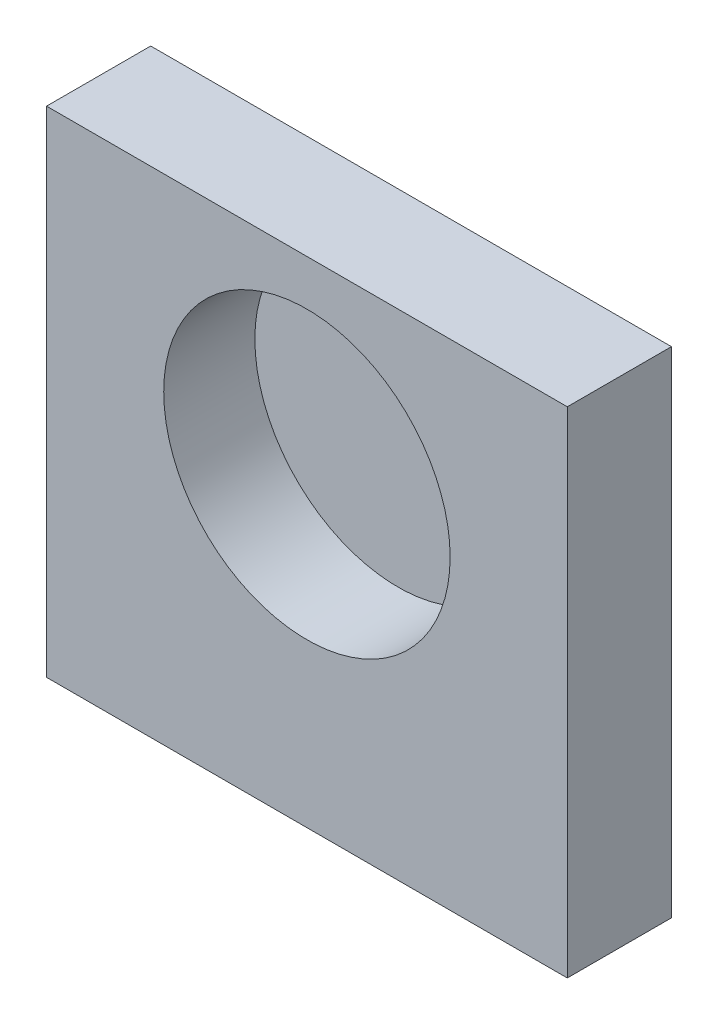
ISO-10303-21;
HEADER;
FILE_DESCRIPTION(('STEP AP214'),'2;1');
FILE_NAME('part.step','',(''),(''),'','','');
FILE_SCHEMA(('AUTOMOTIVE_DESIGN { 1 0 10303 214 1 1 1 1 }'));
ENDSEC;
DATA;
#1=APPLICATION_CONTEXT('core data for automotive mechanical design processes');
#2=APPLICATION_PROTOCOL_DEFINITION('international standard','automotive_design',2000,#1);
#3=PRODUCT_CONTEXT('',#1,'mechanical');
#4=PRODUCT('Part','Part','',(#3));
#5=PRODUCT_RELATED_PRODUCT_CATEGORY('part','',(#4));
#6=PRODUCT_DEFINITION_FORMATION('','',#4);
#7=PRODUCT_DEFINITION_CONTEXT('part definition',#1,'design');
#8=PRODUCT_DEFINITION('design','',#6,#7);
#9=PRODUCT_DEFINITION_SHAPE('','',#8);
#10=(LENGTH_UNIT() NAMED_UNIT(*) SI_UNIT(.MILLI.,.METRE.));
#11=(NAMED_UNIT(*) PLANE_ANGLE_UNIT() SI_UNIT($,.RADIAN.));
#12=(NAMED_UNIT(*) SI_UNIT($,.STERADIAN.) SOLID_ANGLE_UNIT());
#13=UNCERTAINTY_MEASURE_WITH_UNIT(LENGTH_MEASURE(1.E-05),#10,'distance_accuracy_value','');
#14=(GEOMETRIC_REPRESENTATION_CONTEXT(3) GLOBAL_UNCERTAINTY_ASSIGNED_CONTEXT((#13)) GLOBAL_UNIT_ASSIGNED_CONTEXT((#10,
#11,#12)) REPRESENTATION_CONTEXT('',''));
#15=CARTESIAN_POINT('',(0.,0.,0.));
#16=DIRECTION('',(0.,0.,1.));
#17=DIRECTION('',(1.,0.,0.));
#18=AXIS2_PLACEMENT_3D('',#15,#16,#17);
#19=CARTESIAN_POINT('',(-20.,-19.,8.));
#20=DIRECTION('',(1.,0.,0.));
#21=DIRECTION('',(0.,0.,-1.));
#22=AXIS2_PLACEMENT_3D('',#19,#20,#21);
#23=PLANE('',#22);
#24=DIRECTION('',(0.,-1.,0.));
#25=VECTOR('',#24,1.);
#26=CARTESIAN_POINT('',(-20.,-19.,0.));
#27=LINE('',#26,#25);
#28=CARTESIAN_POINT('',(-20.,19.,0.));
#29=VERTEX_POINT('',#28);
#30=CARTESIAN_POINT('',(-20.,-19.,0.));
#31=VERTEX_POINT('',#30);
#32=EDGE_CURVE('E126',#29,#31,#27,.T.);
#33=ORIENTED_EDGE('',*,*,#32,.T.);
#34=DIRECTION('',(0.,0.,-1.));
#35=VECTOR('',#34,1.);
#36=CARTESIAN_POINT('',(-20.,-19.,8.));
#37=LINE('',#36,#35);
#38=CARTESIAN_POINT('',(-20.,-19.,8.));
#39=VERTEX_POINT('',#38);
#40=EDGE_CURVE('E11',#39,#31,#37,.T.);
#41=ORIENTED_EDGE('',*,*,#40,.F.);
#42=DIRECTION('',(0.,-1.,0.));
#43=VECTOR('',#42,1.);
#44=CARTESIAN_POINT('',(-20.,-19.,8.));
#45=LINE('',#44,#43);
#46=CARTESIAN_POINT('',(-20.,19.,8.));
#47=VERTEX_POINT('',#46);
#48=EDGE_CURVE('E129',#47,#39,#45,.T.);
#49=ORIENTED_EDGE('',*,*,#48,.F.);
#50=DIRECTION('',(0.,0.,-1.));
#51=VECTOR('',#50,1.);
#52=CARTESIAN_POINT('',(-20.,19.,8.));
#53=LINE('',#52,#51);
#54=EDGE_CURVE('E135',#47,#29,#53,.T.);
#55=ORIENTED_EDGE('',*,*,#54,.T.);
#56=EDGE_LOOP('',(#33,#41,#49,#55));
#57=FACE_BOUND('',#56,.T.);
#58=ADVANCED_FACE('F42',(#57),#23,.F.);
#59=CARTESIAN_POINT('',(20.,-19.,8.));
#60=DIRECTION('',(0.,1.,0.));
#61=DIRECTION('',(-1.,0.,0.));
#62=AXIS2_PLACEMENT_3D('',#59,#60,#61);
#63=PLANE('',#62);
#64=CARTESIAN_POINT('',(12.,-19.,4.));
#65=DIRECTION('',(0.,-1.,0.));
#66=DIRECTION('',(0.,0.,-1.));
#67=AXIS2_PLACEMENT_3D('',#64,#65,#66);
#68=CIRCLE('',#67,1.883);
#69=CARTESIAN_POINT('',(12.,-19.,2.117));
#70=VERTEX_POINT('',#69);
#71=EDGE_CURVE('E113',#70,#70,#68,.T.);
#72=ORIENTED_EDGE('',*,*,#71,.F.);
#73=EDGE_LOOP('',(#72));
#74=FACE_BOUND('',#73,.T.);
#75=CARTESIAN_POINT('',(-12.,-19.,4.));
#76=DIRECTION('',(0.,-1.,0.));
#77=DIRECTION('',(0.,0.,-1.));
#78=AXIS2_PLACEMENT_3D('',#75,#76,#77);
#79=CIRCLE('',#78,1.883);
#80=CARTESIAN_POINT('',(-12.,-19.,2.117));
#81=VERTEX_POINT('',#80);
#82=EDGE_CURVE('E106',#81,#81,#79,.T.);
#83=ORIENTED_EDGE('',*,*,#82,.F.);
#84=EDGE_LOOP('',(#83));
#85=FACE_BOUND('',#84,.T.);
#86=DIRECTION('',(1.,0.,0.));
#87=VECTOR('',#86,1.);
#88=CARTESIAN_POINT('',(20.,-19.,0.));
#89=LINE('',#88,#87);
#90=CARTESIAN_POINT('',(20.,-19.,0.));
#91=VERTEX_POINT('',#90);
#92=EDGE_CURVE('E138',#31,#91,#89,.T.);
#93=ORIENTED_EDGE('',*,*,#92,.T.);
#94=DIRECTION('',(0.,0.,-1.));
#95=VECTOR('',#94,1.);
#96=CARTESIAN_POINT('',(20.,-19.,8.));
#97=LINE('',#96,#95);
#98=CARTESIAN_POINT('',(20.,-19.,8.));
#99=VERTEX_POINT('',#98);
#100=EDGE_CURVE('E50',#99,#91,#97,.T.);
#101=ORIENTED_EDGE('',*,*,#100,.F.);
#102=DIRECTION('',(1.,0.,0.));
#103=VECTOR('',#102,1.);
#104=CARTESIAN_POINT('',(20.,-19.,8.));
#105=LINE('',#104,#103);
#106=EDGE_CURVE('E89',#39,#99,#105,.T.);
#107=ORIENTED_EDGE('',*,*,#106,.F.);
#108=ORIENTED_EDGE('',*,*,#40,.T.);
#109=EDGE_LOOP('',(#93,#101,#107,#108));
#110=FACE_BOUND('',#109,.T.);
#111=ADVANCED_FACE('F162',(#74,#85,#110),#63,.F.);
#112=CARTESIAN_POINT('',(20.,-19.,8.));
#113=DIRECTION('',(-1.,0.,0.));
#114=DIRECTION('',(0.,0.,1.));
#115=AXIS2_PLACEMENT_3D('',#112,#113,#114);
#116=PLANE('',#115);
#117=DIRECTION('',(0.,1.,0.));
#118=VECTOR('',#117,1.);
#119=CARTESIAN_POINT('',(20.,-19.,0.));
#120=LINE('',#119,#118);
#121=CARTESIAN_POINT('',(20.,19.,0.));
#122=VERTEX_POINT('',#121);
#123=EDGE_CURVE('E76',#91,#122,#120,.T.);
#124=ORIENTED_EDGE('',*,*,#123,.T.);
#125=DIRECTION('',(0.,0.,-1.));
#126=VECTOR('',#125,1.);
#127=CARTESIAN_POINT('',(20.,19.,8.));
#128=LINE('',#127,#126);
#129=CARTESIAN_POINT('',(20.,19.,8.));
#130=VERTEX_POINT('',#129);
#131=EDGE_CURVE('E143',#130,#122,#128,.T.);
#132=ORIENTED_EDGE('',*,*,#131,.F.);
#133=DIRECTION('',(0.,1.,0.));
#134=VECTOR('',#133,1.);
#135=CARTESIAN_POINT('',(20.,-19.,8.));
#136=LINE('',#135,#134);
#137=EDGE_CURVE('E132',#99,#130,#136,.T.);
#138=ORIENTED_EDGE('',*,*,#137,.F.);
#139=ORIENTED_EDGE('',*,*,#100,.T.);
#140=EDGE_LOOP('',(#124,#132,#138,#139));
#141=FACE_BOUND('',#140,.T.);
#142=ADVANCED_FACE('F145',(#141),#116,.F.);
#143=CARTESIAN_POINT('',(20.,19.,8.));
#144=DIRECTION('',(0.,-1.,0.));
#145=DIRECTION('',(1.,0.,0.));
#146=AXIS2_PLACEMENT_3D('',#143,#144,#145);
#147=PLANE('',#146);
#148=DIRECTION('',(-1.,0.,0.));
#149=VECTOR('',#148,1.);
#150=CARTESIAN_POINT('',(20.,19.,0.));
#151=LINE('',#150,#149);
#152=EDGE_CURVE('E82',#122,#29,#151,.T.);
#153=ORIENTED_EDGE('',*,*,#152,.T.);
#154=ORIENTED_EDGE('',*,*,#54,.F.);
#155=DIRECTION('',(-1.,0.,0.));
#156=VECTOR('',#155,1.);
#157=CARTESIAN_POINT('',(20.,19.,8.));
#158=LINE('',#157,#156);
#159=EDGE_CURVE('E58',#130,#47,#158,.T.);
#160=ORIENTED_EDGE('',*,*,#159,.F.);
#161=ORIENTED_EDGE('',*,*,#131,.T.);
#162=EDGE_LOOP('',(#153,#154,#160,#161));
#163=FACE_BOUND('',#162,.T.);
#164=ADVANCED_FACE('F152',(#163),#147,.F.);
#165=CARTESIAN_POINT('',(0.,0.,8.));
#166=DIRECTION('',(0.,0.,1.));
#167=DIRECTION('',(1.,0.,0.));
#168=AXIS2_PLACEMENT_3D('',#165,#166,#167);
#169=PLANE('',#168);
#170=CARTESIAN_POINT('',(0.,4.5,8.));
#171=DIRECTION('',(0.,0.,1.));
#172=DIRECTION('',(1.,0.,0.));
#173=AXIS2_PLACEMENT_3D('',#170,#171,#172);
#174=CIRCLE('',#173,11.);
#175=CARTESIAN_POINT('',(11.,4.5,8.));
#176=VERTEX_POINT('',#175);
#177=EDGE_CURVE('E122',#176,#176,#174,.T.);
#178=ORIENTED_EDGE('',*,*,#177,.F.);
#179=EDGE_LOOP('',(#178));
#180=FACE_BOUND('',#179,.T.);
#181=ORIENTED_EDGE('',*,*,#48,.T.);
#182=ORIENTED_EDGE('',*,*,#106,.T.);
#183=ORIENTED_EDGE('',*,*,#137,.T.);
#184=ORIENTED_EDGE('',*,*,#159,.T.);
#185=EDGE_LOOP('',(#181,#182,#183,#184));
#186=FACE_BOUND('',#185,.T.);
#187=ADVANCED_FACE('F154',(#180,#186),#169,.T.);
#188=CARTESIAN_POINT('',(0.,0.,0.));
#189=DIRECTION('',(0.,0.,1.));
#190=DIRECTION('',(1.,0.,0.));
#191=AXIS2_PLACEMENT_3D('',#188,#189,#190);
#192=PLANE('',#191);
#193=ORIENTED_EDGE('',*,*,#32,.F.);
#194=ORIENTED_EDGE('',*,*,#152,.F.);
#195=ORIENTED_EDGE('',*,*,#123,.F.);
#196=ORIENTED_EDGE('',*,*,#92,.F.);
#197=EDGE_LOOP('',(#193,#194,#195,#196));
#198=FACE_BOUND('',#197,.T.);
#199=ADVANCED_FACE('F148',(#198),#192,.F.);
#200=CARTESIAN_POINT('',(0.,4.5,1.));
#201=DIRECTION('',(0.,0.,1.));
#202=DIRECTION('',(1.,0.,0.));
#203=AXIS2_PLACEMENT_3D('',#200,#201,#202);
#204=CYLINDRICAL_SURFACE('',#203,11.);
#205=CARTESIAN_POINT('',(0.,4.5,1.));
#206=DIRECTION('',(0.,0.,1.));
#207=DIRECTION('',(1.,0.,0.));
#208=AXIS2_PLACEMENT_3D('',#205,#206,#207);
#209=CIRCLE('',#208,11.);
#210=CARTESIAN_POINT('',(11.,4.5,1.));
#211=VERTEX_POINT('',#210);
#212=EDGE_CURVE('E123',#211,#211,#209,.T.);
#213=ORIENTED_EDGE('',*,*,#212,.F.);
#214=EDGE_LOOP('',(#213));
#215=FACE_BOUND('',#214,.T.);
#216=ORIENTED_EDGE('',*,*,#177,.T.);
#217=EDGE_LOOP('',(#216));
#218=FACE_BOUND('',#217,.T.);
#219=ADVANCED_FACE('F196',(#215,#218),#204,.F.);
#220=CARTESIAN_POINT('',(0.,4.5,1.));
#221=DIRECTION('',(0.,0.,1.));
#222=DIRECTION('',(1.,0.,0.));
#223=AXIS2_PLACEMENT_3D('',#220,#221,#222);
#224=PLANE('',#223);
#225=ORIENTED_EDGE('',*,*,#212,.T.);
#226=EDGE_LOOP('',(#225));
#227=FACE_BOUND('',#226,.T.);
#228=ADVANCED_FACE('F192',(#227),#224,.T.);
#229=CARTESIAN_POINT('',(-12.,-9.,4.));
#230=DIRECTION('',(0.,-1.,0.));
#231=DIRECTION('',(0.,0.,-1.));
#232=AXIS2_PLACEMENT_3D('',#229,#230,#231);
#233=CONICAL_SURFACE('',#232,1.575,1.02974425867665);
#234=CARTESIAN_POINT('',(-12.,-8.05364452503159,4.));
#235=VERTEX_POINT('',#234);
#236=VERTEX_LOOP('',#235);
#237=FACE_BOUND('',#236,.T.);
#238=CARTESIAN_POINT('',(-12.,-9.,4.));
#239=DIRECTION('',(0.,-1.,0.));
#240=DIRECTION('',(0.,0.,-1.));
#241=AXIS2_PLACEMENT_3D('',#238,#239,#240);
#242=CIRCLE('',#241,1.575);
#243=CARTESIAN_POINT('',(-12.,-9.,2.425));
#244=VERTEX_POINT('',#243);
#245=EDGE_CURVE('E119',#244,#244,#242,.T.);
#246=ORIENTED_EDGE('',*,*,#245,.T.);
#247=EDGE_LOOP('',(#246));
#248=FACE_BOUND('',#247,.T.);
#249=ADVANCED_FACE('F184',(#237,#248),#233,.F.);
#250=CARTESIAN_POINT('',(-12.,-19.,4.));
#251=DIRECTION('',(0.,-1.,0.));
#252=DIRECTION('',(0.,0.,-1.));
#253=AXIS2_PLACEMENT_3D('',#250,#251,#252);
#254=CYLINDRICAL_SURFACE('',#253,1.575);
#255=ORIENTED_EDGE('',*,*,#245,.F.);
#256=EDGE_LOOP('',(#255));
#257=FACE_BOUND('',#256,.T.);
#258=CARTESIAN_POINT('',(-12.,-18.692,4.));
#259=DIRECTION('',(0.,-1.,0.));
#260=DIRECTION('',(0.,0.,-1.));
#261=AXIS2_PLACEMENT_3D('',#258,#259,#260);
#262=CIRCLE('',#261,1.575);
#263=CARTESIAN_POINT('',(-12.,-18.692,2.425));
#264=VERTEX_POINT('',#263);
#265=EDGE_CURVE('E110',#264,#264,#262,.T.);
#266=ORIENTED_EDGE('',*,*,#265,.T.);
#267=EDGE_LOOP('',(#266));
#268=FACE_BOUND('',#267,.T.);
#269=ADVANCED_FACE('F178',(#257,#268),#254,.F.);
#270=CARTESIAN_POINT('',(-12.,-19.,4.));
#271=DIRECTION('',(0.,-1.,0.));
#272=DIRECTION('',(0.,0.,-1.));
#273=AXIS2_PLACEMENT_3D('',#270,#271,#272);
#274=CONICAL_SURFACE('',#273,1.883,0.785398163397448);
#275=ORIENTED_EDGE('',*,*,#265,.F.);
#276=EDGE_LOOP('',(#275));
#277=FACE_BOUND('',#276,.T.);
#278=ORIENTED_EDGE('',*,*,#82,.T.);
#279=EDGE_LOOP('',(#278));
#280=FACE_BOUND('',#279,.T.);
#281=ADVANCED_FACE('F100',(#277,#280),#274,.F.);
#282=CARTESIAN_POINT('',(12.,-9.,4.));
#283=DIRECTION('',(0.,-1.,0.));
#284=DIRECTION('',(0.,0.,-1.));
#285=AXIS2_PLACEMENT_3D('',#282,#283,#284);
#286=CONICAL_SURFACE('',#285,1.575,1.02974425867665);
#287=CARTESIAN_POINT('',(12.,-8.05364452503159,4.));
#288=VERTEX_POINT('',#287);
#289=VERTEX_LOOP('',#288);
#290=FACE_BOUND('',#289,.T.);
#291=CARTESIAN_POINT('',(12.,-9.,4.));
#292=DIRECTION('',(0.,-1.,0.));
#293=DIRECTION('',(0.,0.,-1.));
#294=AXIS2_PLACEMENT_3D('',#291,#292,#293);
#295=CIRCLE('',#294,1.575);
#296=CARTESIAN_POINT('',(12.,-9.,2.425));
#297=VERTEX_POINT('',#296);
#298=EDGE_CURVE('E104',#297,#297,#295,.T.);
#299=ORIENTED_EDGE('',*,*,#298,.T.);
#300=EDGE_LOOP('',(#299));
#301=FACE_BOUND('',#300,.T.);
#302=ADVANCED_FACE('F96',(#290,#301),#286,.F.);
#303=CARTESIAN_POINT('',(12.,-19.,4.));
#304=DIRECTION('',(0.,-1.,0.));
#305=DIRECTION('',(0.,0.,-1.));
#306=AXIS2_PLACEMENT_3D('',#303,#304,#305);
#307=CYLINDRICAL_SURFACE('',#306,1.575);
#308=ORIENTED_EDGE('',*,*,#298,.F.);
#309=EDGE_LOOP('',(#308));
#310=FACE_BOUND('',#309,.T.);
#311=CARTESIAN_POINT('',(12.,-18.692,4.));
#312=DIRECTION('',(0.,-1.,0.));
#313=DIRECTION('',(0.,0.,-1.));
#314=AXIS2_PLACEMENT_3D('',#311,#312,#313);
#315=CIRCLE('',#314,1.575);
#316=CARTESIAN_POINT('',(12.,-18.692,2.425));
#317=VERTEX_POINT('',#316);
#318=EDGE_CURVE('E107',#317,#317,#315,.T.);
#319=ORIENTED_EDGE('',*,*,#318,.T.);
#320=EDGE_LOOP('',(#319));
#321=FACE_BOUND('',#320,.T.);
#322=ADVANCED_FACE('F99',(#310,#321),#307,.F.);
#323=CARTESIAN_POINT('',(12.,-19.,4.));
#324=DIRECTION('',(0.,-1.,0.));
#325=DIRECTION('',(0.,0.,-1.));
#326=AXIS2_PLACEMENT_3D('',#323,#324,#325);
#327=CONICAL_SURFACE('',#326,1.883,0.785398163397448);
#328=ORIENTED_EDGE('',*,*,#318,.F.);
#329=EDGE_LOOP('',(#328));
#330=FACE_BOUND('',#329,.T.);
#331=ORIENTED_EDGE('',*,*,#71,.T.);
#332=EDGE_LOOP('',(#331));
#333=FACE_BOUND('',#332,.T.);
#334=ADVANCED_FACE('F231',(#330,#333),#327,.F.);
#335=CLOSED_SHELL('',(#58,#111,#142,#164,#187,#199,#219,#228,#249,#269,#281,#302,#322,#334));
#336=MANIFOLD_SOLID_BREP('B2',#335);
#337=ADVANCED_BREP_SHAPE_REPRESENTATION('',(#18,#336),#14);
#338=SHAPE_DEFINITION_REPRESENTATION(#9,#337);
ENDSEC;
END-ISO-10303-21;
